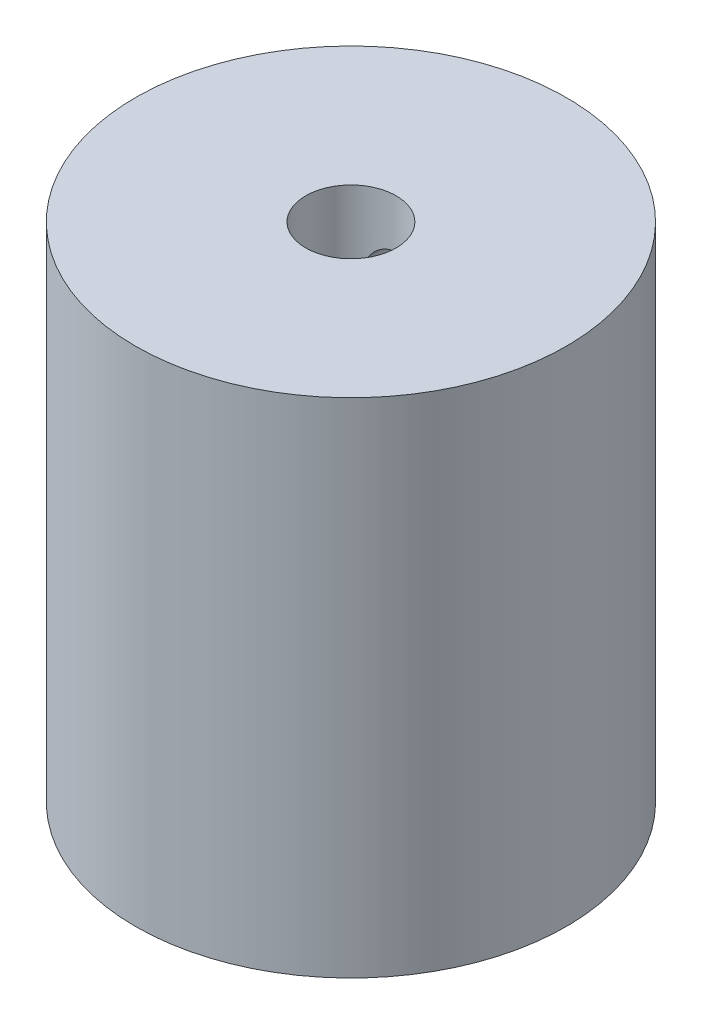
ISO-10303-21;
HEADER;
FILE_DESCRIPTION(('STEP AP214'),'2;1');
FILE_NAME('part.step','',(''),(''),'','','');
FILE_SCHEMA(('AUTOMOTIVE_DESIGN { 1 0 10303 214 1 1 1 1 }'));
ENDSEC;
DATA;
#1=APPLICATION_CONTEXT('core data for automotive mechanical design processes');
#2=APPLICATION_PROTOCOL_DEFINITION('international standard','automotive_design',2000,#1);
#3=PRODUCT_CONTEXT('',#1,'mechanical');
#4=PRODUCT('Part','Part','',(#3));
#5=PRODUCT_RELATED_PRODUCT_CATEGORY('part','',(#4));
#6=PRODUCT_DEFINITION_FORMATION('','',#4);
#7=PRODUCT_DEFINITION_CONTEXT('part definition',#1,'design');
#8=PRODUCT_DEFINITION('design','',#6,#7);
#9=PRODUCT_DEFINITION_SHAPE('','',#8);
#10=(LENGTH_UNIT() NAMED_UNIT(*) SI_UNIT(.MILLI.,.METRE.));
#11=(NAMED_UNIT(*) PLANE_ANGLE_UNIT() SI_UNIT($,.RADIAN.));
#12=(NAMED_UNIT(*) SI_UNIT($,.STERADIAN.) SOLID_ANGLE_UNIT());
#13=UNCERTAINTY_MEASURE_WITH_UNIT(LENGTH_MEASURE(1.E-05),#10,'distance_accuracy_value','');
#14=(GEOMETRIC_REPRESENTATION_CONTEXT(3) GLOBAL_UNCERTAINTY_ASSIGNED_CONTEXT((#13)) GLOBAL_UNIT_ASSIGNED_CONTEXT((#10,
#11,#12)) REPRESENTATION_CONTEXT('',''));
#15=CARTESIAN_POINT('',(0.,0.,0.));
#16=DIRECTION('',(0.,0.,1.));
#17=DIRECTION('',(1.,0.,0.));
#18=AXIS2_PLACEMENT_3D('',#15,#16,#17);
#19=CARTESIAN_POINT('',(0.,50.8,0.));
#20=DIRECTION('',(0.,-1.,0.));
#21=DIRECTION('',(0.,0.,-1.));
#22=AXIS2_PLACEMENT_3D('',#19,#20,#21);
#23=CYLINDRICAL_SURFACE('',#22,19.05);
#24=CARTESIAN_POINT('',(0.,0.,0.));
#25=DIRECTION('',(0.,1.,0.));
#26=DIRECTION('',(0.,0.,1.));
#27=AXIS2_PLACEMENT_3D('',#24,#25,#26);
#28=CIRCLE('',#27,19.05);
#29=CARTESIAN_POINT('',(0.,0.,19.05));
#30=VERTEX_POINT('',#29);
#31=EDGE_CURVE('E42',#30,#30,#28,.T.);
#32=ORIENTED_EDGE('',*,*,#31,.T.);
#33=EDGE_LOOP('',(#32));
#34=FACE_BOUND('',#33,.T.);
#35=CARTESIAN_POINT('',(0.,40.0910968229773,-19.05));
#36=CARTESIAN_POINT('',(-0.111462288333907,40.1016444446425,-19.0499986254831));
#37=CARTESIAN_POINT('',(-0.223885484824858,40.1028176211531,-19.0490113018361));
#38=CARTESIAN_POINT('',(-0.447392160472645,40.0863432467449,-19.0450746746988));
#39=CARTESIAN_POINT('',(-0.558474061276677,40.0686753641748,-19.042123253016));
#40=CARTESIAN_POINT('',(-0.776002773122264,40.0150406690016,-19.0344991232221));
#41=CARTESIAN_POINT('',(-0.882452336153771,39.9790848865815,-19.0298274531316));
#42=CARTESIAN_POINT('',(-1.08776737230284,39.8899301177044,-19.0191966381105));
#43=CARTESIAN_POINT('',(-1.1866342856752,39.8367344158926,-19.0132377385021));
#44=CARTESIAN_POINT('',(-1.37439495961853,39.7143913674772,-19.0005903954759));
#45=CARTESIAN_POINT('',(-1.46325251941923,39.6451887196341,-18.9938994662594));
#46=CARTESIAN_POINT('',(-1.62812104864578,39.4928736432996,-18.9804788627495));
#47=CARTESIAN_POINT('',(-1.7041312922147,39.4097604294067,-18.9737491862892));
#48=CARTESIAN_POINT('',(-1.84142011793276,39.2316166773994,-18.9609191971858));
#49=CARTESIAN_POINT('',(-1.902644439582,39.1365441352471,-18.9548212481803));
#50=CARTESIAN_POINT('',(-2.00824838866711,38.9373945388667,-18.9439243418633));
#51=CARTESIAN_POINT('',(-2.05262839062077,38.8333176849042,-18.9391253556713));
#52=CARTESIAN_POINT('',(-2.12313635293177,38.6194530745283,-18.9313511235054));
#53=CARTESIAN_POINT('',(-2.14932143630461,38.5096843647621,-18.9283701734378));
#54=CARTESIAN_POINT('',(-2.18288913300524,38.2872740548194,-18.924528679991));
#55=CARTESIAN_POINT('',(-2.19027251305868,38.1746325719826,-18.923668050146));
#56=CARTESIAN_POINT('',(-2.18603039786804,37.950352878348,-18.9241584772742));
#57=CARTESIAN_POINT('',(-2.17451211414077,37.8387125955321,-18.9254970602141));
#58=CARTESIAN_POINT('',(-2.13301036933943,37.6189649024836,-18.930219153802));
#59=CARTESIAN_POINT('',(-2.10302686857459,37.5108574998455,-18.9336026688456));
#60=CARTESIAN_POINT('',(-2.02546310064783,37.3012050238598,-18.9420566728828));
#61=CARTESIAN_POINT('',(-1.97787994629412,37.1996610304405,-18.9471274386532));
#62=CARTESIAN_POINT('',(-1.86647794417963,37.0059786475113,-18.9584250889334));
#63=CARTESIAN_POINT('',(-1.80265849988879,36.9138406037555,-18.9646520159189));
#64=CARTESIAN_POINT('',(-1.66016506399712,36.7410204315761,-18.9776575206061));
#65=CARTESIAN_POINT('',(-1.58140805561167,36.660406966814,-18.984439054669));
#66=CARTESIAN_POINT('',(-1.41148463858904,36.51351661597,-18.9978277724568));
#67=CARTESIAN_POINT('',(-1.32031798319862,36.4472400150299,-19.0044349527118));
#68=CARTESIAN_POINT('',(-1.12783477207447,36.3307207461405,-19.0168294671567));
#69=CARTESIAN_POINT('',(-1.02648922299894,36.2805256894293,-19.0226143391906));
#70=CARTESIAN_POINT('',(-0.816735225632816,36.1978880355496,-19.0327732378027));
#71=CARTESIAN_POINT('',(-0.708326961056127,36.1654449768258,-19.0371473010611));
#72=CARTESIAN_POINT('',(-0.487958442219788,36.1193561815773,-19.0440672469612));
#73=CARTESIAN_POINT('',(-0.376013230993062,36.1056395682615,-19.0466200053464));
#74=CARTESIAN_POINT('',(-0.151382336462431,36.0971885471914,-19.0497296086992));
#75=CARTESIAN_POINT('',(-0.0386966748649211,36.1024535854436,-19.0502865119164));
#76=CARTESIAN_POINT('',(0.18368362131808,36.1317522600751,-19.0494376207646));
#77=CARTESIAN_POINT('',(0.293389388079409,36.155701764231,-19.048040602197));
#78=CARTESIAN_POINT('',(0.50722671228206,36.2215759815928,-19.0435465774114));
#79=CARTESIAN_POINT('',(0.611358217503597,36.263500863159,-19.0404495552707));
#80=CARTESIAN_POINT('',(0.811253713655526,36.3641925753549,-19.0329818023438));
#81=CARTESIAN_POINT('',(0.907006429640227,36.4229816579764,-19.0286093885733));
#82=CARTESIAN_POINT('',(1.08731871193081,36.5557162614378,-19.0191588408014));
#83=CARTESIAN_POINT('',(1.17187793919961,36.6296622411888,-19.0140806854336));
#84=CARTESIAN_POINT('',(1.32780081229545,36.7910063205044,-19.003830966767));
#85=CARTESIAN_POINT('',(1.39910325341015,36.878463560052,-18.9986590855818));
#86=CARTESIAN_POINT('',(1.5260277903391,37.0641288950119,-18.988886352215));
#87=CARTESIAN_POINT('',(1.58164986136074,37.1623370074223,-18.9842855009362));
#88=CARTESIAN_POINT('',(1.67565264686235,37.3667951532447,-18.9762200328876));
#89=CARTESIAN_POINT('',(1.71402402562135,37.4730495048622,-18.9727560316308));
#90=CARTESIAN_POINT('',(1.77236686205823,37.690532622102,-18.9673952411231));
#91=CARTESIAN_POINT('',(1.79233880267813,37.8017612570807,-18.9654984107377));
#92=CARTESIAN_POINT('',(1.81325656040918,38.0255672797187,-18.9635100400516));
#93=CARTESIAN_POINT('',(1.81427686501878,38.1381376461198,-18.9634114320466));
#94=CARTESIAN_POINT('',(1.79745221610363,38.3618455057139,-18.9650134372432));
#95=CARTESIAN_POINT('',(1.77960743190072,38.4729830117583,-18.9667140342962));
#96=CARTESIAN_POINT('',(1.72562007016188,38.6904797933734,-18.9717015913895));
#97=CARTESIAN_POINT('',(1.68950869843779,38.7968468822509,-18.9749858455359));
#98=CARTESIAN_POINT('',(1.60004288010323,39.0020130768677,-18.9827386704948));
#99=CARTESIAN_POINT('',(1.54668861682472,39.1008122630576,-18.9872072287154));
#100=CARTESIAN_POINT('',(1.4240459935309,39.2883955373522,-18.9967990874949));
#101=CARTESIAN_POINT('',(1.35470619570617,39.377145885421,-19.0019244774194));
#102=CARTESIAN_POINT('',(1.20211758446651,39.5417952572049,-19.012186746575));
#103=CARTESIAN_POINT('',(1.11886539954164,39.617691156791,-19.0173236282926));
#104=CARTESIAN_POINT('',(0.94051207529221,39.7546950373763,-19.0269790259655));
#105=CARTESIAN_POINT('',(0.845373047080914,39.8157538056972,-19.0314954630325));
#106=CARTESIAN_POINT('',(0.6462106142411,39.9209638142367,-19.0392962057982));
#107=CARTESIAN_POINT('',(0.542197237969539,39.9651338378104,-19.0425818802454));
#108=CARTESIAN_POINT('',(0.364701051125943,40.0234068828396,-19.0466401256108));
#109=CARTESIAN_POINT('',(0.292864934641595,40.042626632472,-19.0478873495204));
#110=CARTESIAN_POINT('',(0.147493560764058,40.0729722689485,-19.0495677412892));
#111=CARTESIAN_POINT('',(0.0739583093861158,40.0840981844417,-19.0500009120299));
#112=CARTESIAN_POINT('',(0.,40.0910968229773,-19.05));
#113=B_SPLINE_CURVE_WITH_KNOTS('',3,(#35,#36,#37,#38,#39,#40,#41,#42,#43,#44,#45,#46,#47,#48,
#49,#50,#51,#52,#53,#54,#55,#56,#57,#58,#59,#60,#61,#62,#63,#64,#65,#66,#67,#68,#69,#70,#71,#72,
#73,#74,#75,#76,#77,#78,#79,#80,#81,#82,#83,#84,#85,#86,#87,#88,#89,#90,#91,#92,#93,#94,#95,#96,
#97,#98,#99,#100,#101,#102,#103,#104,#105,#106,#107,#108,#109,#110,#111,#112),.UNSPECIFIED.,.T.,
.F.,(4,2,2,2,2,2,2,2,2,2,2,2,2,2,2,2,2,2,2,2,2,2,2,2,2,2,2,2,2,2,2,2,2,2,2,2,2,2,4),(0.,
0.335609641898661,0.671581811697275,1.00735158276076,1.34305741867082,1.67994085676281,
2.01684332197983,2.35496395912798,2.69307707803787,3.03012383415124,3.36715684541785,
3.70228478197322,4.03741343888479,4.37259709745657,4.70779307263589,5.04490961646615,
5.38203286449639,5.72014517355423,6.0582486912125,6.39506895659072,6.73187939170393,
7.06718193223751,7.40248761334199,7.73823777516334,8.07399810412051,8.41127205539059,
8.74854653992923,9.08600333143046,9.42345126523133,9.75957261200553,10.0956909419796,
10.4312369921317,10.7667794747676,11.1034171107523,11.4401364456873,11.7779578362099,
12.1154024074063,12.3380894700681,12.560775744498),.UNSPECIFIED.);
#114=CARTESIAN_POINT('',(0.,40.0910968229773,-19.05));
#115=VERTEX_POINT('',#114);
#116=EDGE_CURVE('E91',#115,#115,#113,.T.);
#117=ORIENTED_EDGE('',*,*,#116,.T.);
#118=EDGE_LOOP('',(#117));
#119=FACE_BOUND('',#118,.T.);
#120=CARTESIAN_POINT('',(0.,16.7,-19.05));
#121=CARTESIAN_POINT('',(-0.222068925322549,16.699992124563,-19.0499958890331));
#122=CARTESIAN_POINT('',(-0.444235075035388,16.6814445605494,-19.0460773116431));
#123=CARTESIAN_POINT('',(-0.882271537038069,16.607812711146,-19.0308235650712));
#124=CARTESIAN_POINT('',(-1.09813698237215,16.5527009229103,-19.0194828131717));
#125=CARTESIAN_POINT('',(-1.51717686815667,16.4077311763298,-18.9906491711922));
#126=CARTESIAN_POINT('',(-1.72036380510909,16.3179080800083,-18.9731624553515));
#127=CARTESIAN_POINT('',(-2.10877290109242,16.106172791117,-18.9339307078345));
#128=CARTESIAN_POINT('',(-2.29399581150178,15.9842619414694,-18.9121858543776));
#129=CARTESIAN_POINT('',(-2.64398067088604,15.7098938257733,-18.8664641330736));
#130=CARTESIAN_POINT('',(-2.80843747373957,15.5570515870158,-18.8424614095206));
#131=CARTESIAN_POINT('',(-3.10957763327856,15.2259863279562,-18.7951141928768));
#132=CARTESIAN_POINT('',(-3.24625866456806,15.0477611847124,-18.7717697550388));
#133=CARTESIAN_POINT('',(-3.48929104663889,14.6687623018821,-18.7281285478734));
#134=CARTESIAN_POINT('',(-3.59532178856858,14.4677788097036,-18.7078649771252));
#135=CARTESIAN_POINT('',(-3.77198848371869,14.0503519372427,-18.6730491291224));
#136=CARTESIAN_POINT('',(-3.84262831460581,13.8339102536343,-18.6584962262065));
#137=CARTESIAN_POINT('',(-3.94550800161392,13.3950083947487,-18.6370119818747));
#138=CARTESIAN_POINT('',(-3.97828582224052,13.1726796501261,-18.6299739764396));
#139=CARTESIAN_POINT('',(-4.00618294523534,12.7255758102061,-18.6239957247587));
#140=CARTESIAN_POINT('',(-4.00130650220157,12.500800994159,-18.6250545636412));
#141=CARTESIAN_POINT('',(-3.95446741168988,12.0591543428282,-18.6350536290509));
#142=CARTESIAN_POINT('',(-3.91312574011326,11.842213212293,-18.6438618823821));
#143=CARTESIAN_POINT('',(-3.79551181000077,11.4184160573753,-18.6681590654145));
#144=CARTESIAN_POINT('',(-3.7192377303702,11.2115605593987,-18.6836483434082));
#145=CARTESIAN_POINT('',(-3.53334311031738,10.8120398996319,-18.7196947016604));
#146=CARTESIAN_POINT('',(-3.42348028986359,10.6194909093622,-18.7402883893546));
#147=CARTESIAN_POINT('',(-3.17369742321451,10.2553299532651,-18.7842002311989));
#148=CARTESIAN_POINT('',(-3.03377358572095,10.0837206326352,-18.807518728833));
#149=CARTESIAN_POINT('',(-2.72453546628349,9.76273132831383,-18.8548216674733));
#150=CARTESIAN_POINT('',(-2.55469219759243,9.6138610919571,-18.8788101315769));
#151=CARTESIAN_POINT('',(-2.19218417647366,9.34663856334619,-18.9243268374777));
#152=CARTESIAN_POINT('',(-1.99951907116605,9.22828674306926,-18.9458550412231));
#153=CARTESIAN_POINT('',(-1.59624102671132,9.02534988401876,-18.9840870793149));
#154=CARTESIAN_POINT('',(-1.38559562348826,8.9408275600518,-19.0007819376649));
#155=CARTESIAN_POINT('',(-0.952664921948436,8.80851641409334,-19.0273988976709));
#156=CARTESIAN_POINT('',(-0.730381185010913,8.76072267807545,-19.0373219053329));
#157=CARTESIAN_POINT('',(-0.28485989075043,8.70395737117101,-19.049149480448));
#158=CARTESIAN_POINT('',(-0.061714838399146,8.69428887879044,-19.0511979746538));
#159=CARTESIAN_POINT('',(0.383001961614817,8.71216531317421,-19.0474473370268));
#160=CARTESIAN_POINT('',(0.604573806347773,8.73970792351867,-19.0416486936844));
#161=CARTESIAN_POINT('',(1.03757450773072,8.83064625721493,-19.0229457857817));
#162=CARTESIAN_POINT('',(1.24908270909998,8.89368023589078,-19.010113248408));
#163=CARTESIAN_POINT('',(1.65852586547622,9.05341345993724,-18.9787773959848));
#164=CARTESIAN_POINT('',(1.85645972706494,9.15011541347253,-18.9602736247702));
#165=CARTESIAN_POINT('',(2.2360448845367,9.3759181491571,-18.9192909648564));
#166=CARTESIAN_POINT('',(2.417444259199,9.50543321529357,-18.8967624235737));
#167=CARTESIAN_POINT('',(2.75618489864534,9.79263583297054,-18.8503376155355));
#168=CARTESIAN_POINT('',(2.91352329640621,9.95032673700008,-18.8264411862527));
#169=CARTESIAN_POINT('',(3.20239990817954,10.2925910331731,-18.7794824306353));
#170=CARTESIAN_POINT('',(3.33345745712966,10.4775734966044,-18.7564410101124));
#171=CARTESIAN_POINT('',(3.56264507746954,10.8673346631343,-18.7142644792401));
#172=CARTESIAN_POINT('',(3.66077652930163,11.072112535837,-18.6951292051368));
#173=CARTESIAN_POINT('',(3.82069185787998,11.4945797842213,-18.6631045656276));
#174=CARTESIAN_POINT('',(3.88267333804618,11.7121916681422,-18.6501813135812));
#175=CARTESIAN_POINT('',(3.96911860327334,12.1550450380471,-18.6319774664542));
#176=CARTESIAN_POINT('',(3.99358785194212,12.3802854080668,-18.6266957583988));
#177=CARTESIAN_POINT('',(4.00409587895899,12.8271656714027,-18.6244391951431));
#178=CARTESIAN_POINT('',(3.99089548033069,13.0487871884021,-18.6272998829629));
#179=CARTESIAN_POINT('',(3.92812942119298,13.4865738154656,-18.640635996824));
#180=CARTESIAN_POINT('',(3.87856412163439,13.7027389796663,-18.6511113472837));
#181=CARTESIAN_POINT('',(3.74482955393731,14.1229298421152,-18.6784194448329));
#182=CARTESIAN_POINT('',(3.66076270312905,14.3269894408091,-18.6952333640481));
#183=CARTESIAN_POINT('',(3.46050261504679,14.7182238959422,-18.7333330032989));
#184=CARTESIAN_POINT('',(3.34430633810606,14.905397152593,-18.7546191463922));
#185=CARTESIAN_POINT('',(3.08052640829362,15.2613146015125,-18.799761802575));
#186=CARTESIAN_POINT('',(2.93239704200651,15.42964927971,-18.8236588987998));
#187=CARTESIAN_POINT('',(2.6100718526422,15.739322773776,-18.8710494636146));
#188=CARTESIAN_POINT('',(2.43587003354924,15.8806553627702,-18.8945428379694));
#189=CARTESIAN_POINT('',(2.06388072100253,16.1338930103403,-18.9388055080564));
#190=CARTESIAN_POINT('',(1.86584011856859,16.2454327355831,-18.9595395475968));
#191=CARTESIAN_POINT('',(1.45343664588518,16.4334684099519,-18.9955971543492));
#192=CARTESIAN_POINT('',(1.23908814660464,16.5099948060187,-19.010925419653));
#193=CARTESIAN_POINT('',(0.853661563895487,16.6116245155711,-19.0315926707954));
#194=CARTESIAN_POINT('',(0.684722698580901,16.6447040979823,-19.0384538019923));
#195=CARTESIAN_POINT('',(0.343875247613555,16.6888944717263,-19.0476589724282));
#196=CARTESIAN_POINT('',(0.17196677516171,16.7000060986178,-19.0500031834698));
#197=CARTESIAN_POINT('',(0.,16.7,-19.05));
#198=B_SPLINE_CURVE_WITH_KNOTS('',3,(#120,#121,#122,#123,#124,#125,#126,#127,#128,#129,#130,
#131,#132,#133,#134,#135,#136,#137,#138,#139,#140,#141,#142,#143,#144,#145,#146,#147,#148,#149,
#150,#151,#152,#153,#154,#155,#156,#157,#158,#159,#160,#161,#162,#163,#164,#165,#166,#167,#168,
#169,#170,#171,#172,#173,#174,#175,#176,#177,#178,#179,#180,#181,#182,#183,#184,#185,#186,#187,
#188,#189,#190,#191,#192,#193,#194,#195,#196,#197),.UNSPECIFIED.,.T.,.F.,(4,2,2,2,2,2,2,2,2,2,2,
2,2,2,2,2,2,2,2,2,2,2,2,2,2,2,2,2,2,2,2,2,2,2,2,2,2,2,4),(0.,0.665577483555513,1.33165616903821,
1.9970676151165,2.66245121712301,3.33669100559305,4.01098721838724,4.69210067442244,
5.37313948674806,6.04437784331528,6.71554035700825,7.37548947836377,8.03547300807341,
8.70033412689438,9.36527914733833,10.0434434039141,10.721618147892,11.401044366609,
12.0803796670492,12.7472376555101,13.4140541334588,14.0741940339241,14.7343870466057,
15.4033713659849,16.0724353372245,16.7528001366121,17.4331364078156,18.1097180926988,
18.7862012249723,19.4491185439256,20.1120292829813,20.7729862536949,21.4340057769334,
22.107371752777,22.7808928246771,23.4623287382506,24.1431709562993,24.6586035724101,
25.1740165834878),.UNSPECIFIED.);
#199=CARTESIAN_POINT('',(0.,16.7,-19.05));
#200=VERTEX_POINT('',#199);
#201=EDGE_CURVE('E10',#200,#200,#198,.T.);
#202=ORIENTED_EDGE('',*,*,#201,.T.);
#203=EDGE_LOOP('',(#202));
#204=FACE_BOUND('',#203,.T.);
#205=CARTESIAN_POINT('',(0.,44.45,0.));
#206=DIRECTION('',(0.,1.,0.));
#207=DIRECTION('',(0.,0.,1.));
#208=AXIS2_PLACEMENT_3D('',#205,#206,#207);
#209=CIRCLE('',#208,19.05);
#210=CARTESIAN_POINT('',(0.,44.45,19.05));
#211=VERTEX_POINT('',#210);
#212=EDGE_CURVE('E118',#211,#211,#209,.T.);
#213=ORIENTED_EDGE('',*,*,#212,.F.);
#214=EDGE_LOOP('',(#213));
#215=FACE_BOUND('',#214,.T.);
#216=ADVANCED_FACE('F34',(#34,#119,#204,#215),#23,.T.);
#217=CARTESIAN_POINT('',(0.,25.4,0.));
#218=DIRECTION('',(0.,1.,0.));
#219=DIRECTION('',(0.,0.,1.));
#220=AXIS2_PLACEMENT_3D('',#217,#218,#219);
#221=CYLINDRICAL_SURFACE('',#220,4.0000047);
#222=CARTESIAN_POINT('',(0.,25.4,0.));
#223=DIRECTION('',(0.,1.,0.));
#224=DIRECTION('',(0.,0.,1.));
#225=AXIS2_PLACEMENT_3D('',#222,#223,#224);
#226=CIRCLE('',#225,4.0000047);
#227=CARTESIAN_POINT('',(0.,25.4,4.0000047));
#228=VERTEX_POINT('',#227);
#229=EDGE_CURVE('E47',#228,#228,#226,.T.);
#230=ORIENTED_EDGE('',*,*,#229,.F.);
#231=EDGE_LOOP('',(#230));
#232=FACE_BOUND('',#231,.T.);
#233=CARTESIAN_POINT('',(-2.18850316052976,38.1,-3.34820720929475));
#234=CARTESIAN_POINT('',(-2.1884944304029,38.2022781299785,-3.34821840267547));
#235=CARTESIAN_POINT('',(-2.1805990815075,38.3046949917604,-3.35341495904084));
#236=CARTESIAN_POINT('',(-2.14946786724471,38.5062975409165,-3.37344690303555));
#237=CARTESIAN_POINT('',(-2.12619812161038,38.6054755832608,-3.38830357733403));
#238=CARTESIAN_POINT('',(-2.06571100695699,38.7972367341408,-3.42550948670615));
#239=CARTESIAN_POINT('',(-2.02858046533959,38.8898567143113,-3.4478119892699));
#240=CARTESIAN_POINT('',(-1.94173254670474,39.0674557297682,-3.4974572629338));
#241=CARTESIAN_POINT('',(-1.89201437210667,39.1524342804138,-3.52480035338703));
#242=CARTESIAN_POINT('',(-1.77577408698848,39.3215147211666,-3.58487712852418));
#243=CARTESIAN_POINT('',(-1.70808464910241,39.4047194288201,-3.61787647758237));
#244=CARTESIAN_POINT('',(-1.560323073814,39.5592990123534,-3.68401789074684));
#245=CARTESIAN_POINT('',(-1.48024322761059,39.6306664659146,-3.71716003112711));
#246=CARTESIAN_POINT('',(-1.30073403276202,39.7663679171168,-3.78393259807259));
#247=CARTESIAN_POINT('',(-1.20018364228522,39.8293610542193,-3.81730221454794));
#248=CARTESIAN_POINT('',(-0.98797279534801,39.9371127337521,-3.87763909996497));
#249=CARTESIAN_POINT('',(-0.876318235441333,39.9818808903859,-3.90460974140963));
#250=CARTESIAN_POINT('',(-0.652520461038015,40.0486991218174,-3.94796057556278));
#251=CARTESIAN_POINT('',(-0.540872607693723,40.0720275058841,-3.96491132848344));
#252=CARTESIAN_POINT('',(-0.314239836798642,40.0992965272806,-3.98926576051751));
#253=CARTESIAN_POINT('',(-0.199257643098608,40.1032525648893,-3.99667701970938));
#254=CARTESIAN_POINT('',(0.0180237655762515,40.0919707035726,-4.00128755475805));
#255=CARTESIAN_POINT('',(0.120409145327254,40.0786683714472,-3.99946030392493));
#256=CARTESIAN_POINT('',(0.321517073031992,40.0366029468605,-3.98833361047159));
#257=CARTESIAN_POINT('',(0.420239614250007,40.0078398259694,-3.97903415411118));
#258=CARTESIAN_POINT('',(0.610775045676808,39.936152328759,-3.95426020514948));
#259=CARTESIAN_POINT('',(0.702629149454106,39.8933224368836,-3.93882677205921));
#260=CARTESIAN_POINT('',(0.878185953016703,39.7947909900025,-3.9034416509819));
#261=CARTESIAN_POINT('',(0.961886163740379,39.7390855219846,-3.88348858947295));
#262=CARTESIAN_POINT('',(1.12612758063989,39.611111936303,-3.83923078457058));
#263=CARTESIAN_POINT('',(1.20583989774665,39.5378571599636,-3.81470292135931));
#264=CARTESIAN_POINT('',(1.35242903888901,39.3795237803228,-3.76523180579996));
#265=CARTESIAN_POINT('',(1.41929751626423,39.2944375497585,-3.74028829470389));
#266=CARTESIAN_POINT('',(1.54267469408649,39.1081229242315,-3.69119136234157));
#267=CARTESIAN_POINT('',(1.59820492162458,39.0061989026781,-3.66719947509194));
#268=CARTESIAN_POINT('',(1.69109955991893,38.7932275969482,-3.62530533450885));
#269=CARTESIAN_POINT('',(1.7284764253795,38.6821866290684,-3.6073989085866));
#270=CARTESIAN_POINT('',(1.78185441719786,38.460496873816,-3.58132345228501));
#271=CARTESIAN_POINT('',(1.79891987596194,38.3501636027117,-3.57267225292632));
#272=CARTESIAN_POINT('',(1.81439781787948,38.1278908475421,-3.56484031289378));
#273=CARTESIAN_POINT('',(1.81282184043491,38.0159523999745,-3.5656537134483));
#274=CARTESIAN_POINT('',(1.79213705414682,37.8045058587303,-3.57608469246248));
#275=CARTESIAN_POINT('',(1.77463654282146,37.7047934578228,-3.58489447593977));
#276=CARTESIAN_POINT('',(1.72509814200645,37.5098745290153,-3.60899234196184));
#277=CARTESIAN_POINT('',(1.69305617605346,37.4146692728913,-3.62428224102345));
#278=CARTESIAN_POINT('',(1.61418578312999,37.2276635607348,-3.66010534149101));
#279=CARTESIAN_POINT('',(1.56688284723725,37.1360958870705,-3.68080207511892));
#280=CARTESIAN_POINT('',(1.45916594000513,36.9617109869241,-3.72481600402481));
#281=CARTESIAN_POINT('',(1.39874570538024,36.8788979688251,-3.74813444855158));
#282=CARTESIAN_POINT('',(1.2592781431608,36.7155889744072,-3.79740122994369));
#283=CARTESIAN_POINT('',(1.17896353125564,36.6361786336945,-3.82337656560467));
#284=CARTESIAN_POINT('',(1.00559870300246,36.4916289023058,-3.8725858982404));
#285=CARTESIAN_POINT('',(0.912546334190237,36.4264919284348,-3.8958194306588));
#286=CARTESIAN_POINT('',(0.714851807652179,36.3119529739072,-3.93691484987749));
#287=CARTESIAN_POINT('',(0.610108918202506,36.2627046746065,-3.9547241845003));
#288=CARTESIAN_POINT('',(0.39276015050496,36.1828387800168,-3.98217723228771));
#289=CARTESIAN_POINT('',(0.280160822143259,36.1522058672384,-3.99182766149358));
#290=CARTESIAN_POINT('',(0.061069806672386,36.112792306547,-4.00090727434662));
#291=CARTESIAN_POINT('',(-0.045085580286732,36.1023237182156,-4.00116231438237));
#292=CARTESIAN_POINT('',(-0.257373818376916,36.0983709971328,-3.99312744251863));
#293=CARTESIAN_POINT('',(-0.363506669120251,36.1048829875414,-3.98483948133503));
#294=CARTESIAN_POINT('',(-0.567312475452336,36.1336378754805,-3.96083549708654));
#295=CARTESIAN_POINT('',(-0.665144912671912,36.1550924105598,-3.94550431138684));
#296=CARTESIAN_POINT('',(-0.855451627124892,36.2118668364099,-3.90866251689987));
#297=CARTESIAN_POINT('',(-0.947924900096445,36.247189316336,-3.88715075439567));
#298=CARTESIAN_POINT('',(-1.13088122721322,36.3328782564398,-3.83805117514352));
#299=CARTESIAN_POINT('',(-1.22093134366037,36.3840039439346,-3.8101815158382));
#300=CARTESIAN_POINT('',(-1.39142872773225,36.4988898434935,-3.7512816543463));
#301=CARTESIAN_POINT('',(-1.47187089488486,36.562656718902,-3.72024978952791));
#302=CARTESIAN_POINT('',(-1.63008760462597,36.7090745536958,-3.65389971731174));
#303=CARTESIAN_POINT('',(-1.70662376710105,36.7930242467212,-3.61848199490624));
#304=CARTESIAN_POINT('',(-1.84487200656139,36.9733330592404,-3.54999261181833));
#305=CARTESIAN_POINT('',(-1.90656939729408,37.0697043289672,-3.51692329802689));
#306=CARTESIAN_POINT('',(-2.01460374745787,37.2758719616801,-3.45620765254901));
#307=CARTESIAN_POINT('',(-2.06051101888525,37.3859470218439,-3.4287202952848));
#308=CARTESIAN_POINT('',(-2.11431850556389,37.5570318188717,-3.39560451856878));
#309=CARTESIAN_POINT('',(-2.1297365902923,37.6149874814546,-3.38592476157086));
#310=CARTESIAN_POINT('',(-2.15535607567979,37.7324510040909,-3.3696752298573));
#311=CARTESIAN_POINT('',(-2.16556166775395,37.7919575764425,-3.3631029567011));
#312=CARTESIAN_POINT('',(-2.17819007645512,37.8929763981079,-3.35493098683599));
#313=CARTESIAN_POINT('',(-2.18205255258444,37.9342416681691,-3.35241661045777));
#314=CARTESIAN_POINT('',(-2.18721099923633,38.0169969919991,-3.34905236388782));
#315=CARTESIAN_POINT('',(-2.1885067039379,38.0584870686034,-3.3482026660943));
#316=CARTESIAN_POINT('',(-2.18850316052976,38.1,-3.34820720929475));
#317=B_SPLINE_CURVE_WITH_KNOTS('',3,(#233,#234,#235,#236,#237,#238,#239,#240,#241,#242,#243,
#244,#245,#246,#247,#248,#249,#250,#251,#252,#253,#254,#255,#256,#257,#258,#259,#260,#261,#262,
#263,#264,#265,#266,#267,#268,#269,#270,#271,#272,#273,#274,#275,#276,#277,#278,#279,#280,#281,
#282,#283,#284,#285,#286,#287,#288,#289,#290,#291,#292,#293,#294,#295,#296,#297,#298,#299,#300,
#301,#302,#303,#304,#305,#306,#307,#308,#309,#310,#311,#312,#313,#314,#315,#316),.UNSPECIFIED.,
.T.,.F.,(4,2,2,2,2,2,2,2,2,2,2,2,2,2,2,2,2,2,2,2,2,2,2,2,2,2,2,2,2,2,2,2,2,2,2,2,2,2,2,2,2,4),
(0.,0.306661723354928,0.614001495447451,0.91944747034191,1.22491280382314,1.56022887610277,
1.89575441336615,2.2636184882217,2.63128825190089,2.97525981237811,3.31895788409979,
3.62724456445323,3.93553181169762,4.24178929816621,4.54813998191631,4.87973907113439,
5.21155292865033,5.56532610328867,5.91885621626345,6.2529067028507,6.58675041668887,
6.89021886401505,7.19377243644884,7.50785932112568,7.82209650805073,8.16818431172019,
8.51433067070211,8.86373115072717,9.21284373930146,9.53118854759517,9.8494606808736,
10.1521002915271,10.4547964321058,10.7752013186229,11.0957755462064,11.4511632496258,
11.8069012536879,12.171669777902,12.3536484653475,12.5354805906992,12.6599364142272,
12.7844051260256),.UNSPECIFIED.);
#318=CARTESIAN_POINT('',(-2.18850316052976,38.1,-3.34820720929475));
#319=VERTEX_POINT('',#318);
#320=EDGE_CURVE('E86',#319,#319,#317,.T.);
#321=ORIENTED_EDGE('',*,*,#320,.T.);
#322=EDGE_LOOP('',(#321));
#323=FACE_BOUND('',#322,.T.);
#324=CARTESIAN_POINT('',(0.,36.1089031770227,4.0000047));
#325=CARTESIAN_POINT('',(0.105722005968482,36.1189198876956,3.99999829910437));
#326=CARTESIAN_POINT('',(0.210779208982802,36.1374053526245,3.99576791693113));
#327=CARTESIAN_POINT('',(0.41619125726617,36.1906402591726,3.97963543758881));
#328=CARTESIAN_POINT('',(0.516535745724085,36.2254238320162,3.9677172208616));
#329=CARTESIAN_POINT('',(0.70930459855935,36.3097592869777,3.93781666383938));
#330=CARTESIAN_POINT('',(0.801759880715031,36.3592497541267,3.91985950148499));
#331=CARTESIAN_POINT('',(0.977179092163339,36.4714921839532,3.87985373242204));
#332=CARTESIAN_POINT('',(1.06014381336333,36.5342430389171,3.85780546748467));
#333=CARTESIAN_POINT('',(1.21987080561899,36.6757268311079,3.81042174610676));
#334=CARTESIAN_POINT('',(1.29593745360082,36.7552055178438,3.78496750616135));
#335=CARTESIAN_POINT('',(1.43418160413739,36.9257129256404,3.73477985325307));
#336=CARTESIAN_POINT('',(1.49635152382003,37.0167479102275,3.71004684020289));
#337=CARTESIAN_POINT('',(1.60785758024488,37.2131844248921,3.66315092793704));
#338=CARTESIAN_POINT('',(1.65642954009531,37.3190672682974,3.64116967235679));
#339=CARTESIAN_POINT('',(1.734668256141,37.5387734957882,3.60456052428096));
#340=CARTESIAN_POINT('',(1.76435289639544,37.6525892546699,3.58992567838396));
#341=CARTESIAN_POINT('',(1.80182635229963,37.8755705825806,3.57125565910549));
#342=CARTESIAN_POINT('',(1.8111237208077,37.9844204611951,3.56649176762262));
#343=CARTESIAN_POINT('',(1.81184750516752,38.2021769411103,3.56612555650796));
#344=CARTESIAN_POINT('',(1.80327979598495,38.3110835119928,3.57052022506556));
#345=CARTESIAN_POINT('',(1.77003809195016,38.5174070848073,3.58710194480146));
#346=CARTESIAN_POINT('',(1.74660300266844,38.6150779095115,3.5986882343722));
#347=CARTESIAN_POINT('',(1.68575636166771,38.8050585905212,3.62758740342207));
#348=CARTESIAN_POINT('',(1.64834059421902,38.8973668200803,3.64490201003562));
#349=CARTESIAN_POINT('',(1.55801417430275,39.0801481195226,3.68445312653343));
#350=CARTESIAN_POINT('',(1.50430489781287,39.1701744990069,3.70692355474283));
#351=CARTESIAN_POINT('',(1.38377229210733,39.3405028208336,3.75358316690589));
#352=CARTESIAN_POINT('',(1.31694200809023,39.4207995693151,3.77777325801166));
#353=CARTESIAN_POINT('',(1.16463931658397,39.5771587270107,3.82761653375519));
#354=CARTESIAN_POINT('',(1.07800784962275,39.6521224112157,3.85319490823815));
#355=CARTESIAN_POINT('',(0.892478577722044,39.7865930436423,3.90034193905956));
#356=CARTESIAN_POINT('',(0.793581768594448,39.8461012454681,3.92191092056211));
#357=CARTESIAN_POINT('',(0.587714492630396,39.9467216217177,3.95794787535126));
#358=CARTESIAN_POINT('',(0.480908959568448,39.9881280415864,3.97252983097728));
#359=CARTESIAN_POINT('',(0.261041547772513,40.0521760681745,3.99299964985255));
#360=CARTESIAN_POINT('',(0.147984775029227,40.0748327549571,3.99889450296289));
#361=CARTESIAN_POINT('',(-0.0699038227528762,40.0992085695157,4.0007404861427));
#362=CARTESIAN_POINT('',(-0.174538008904065,40.102658741539,3.9975547249352));
#363=CARTESIAN_POINT('',(-0.382489413361365,40.0932882556174,3.98303866478752));
#364=CARTESIAN_POINT('',(-0.485806752698557,40.0804691040342,3.97170911991494));
#365=CARTESIAN_POINT('',(-0.685270461373114,40.0399211066845,3.9421228260626));
#366=CARTESIAN_POINT('',(-0.781537160381606,40.0126261047807,3.92407198110652));
#367=CARTESIAN_POINT('',(-0.967859434099243,39.9445729771571,3.88232039694961));
#368=CARTESIAN_POINT('',(-1.0579136159706,39.9038118441309,3.85861839604093));
#369=CARTESIAN_POINT('',(-1.23674468486864,39.806553801356,3.80524098861128));
#370=CARTESIAN_POINT('',(-1.32490217474173,39.7490950277631,3.77524816309945));
#371=CARTESIAN_POINT('',(-1.49069596082293,39.6215941692303,3.71291299694917));
#372=CARTESIAN_POINT('',(-1.56832456325182,39.5515429686134,3.68056896443826));
#373=CARTESIAN_POINT('',(-1.71932195327778,39.3922302210046,3.61268802841173));
#374=CARTESIAN_POINT('',(-1.79139631420565,39.3017258236578,3.57717094521164));
#375=CARTESIAN_POINT('',(-1.91945358072902,39.1085879617556,3.51012356401689));
#376=CARTESIAN_POINT('',(-1.97543321348576,39.0059520362514,3.47859407762311));
#377=CARTESIAN_POINT('',(-2.0687452099048,38.791499451663,3.423925087845));
#378=CARTESIAN_POINT('',(-2.10625564634755,38.6797830712809,3.40070607815607));
#379=CARTESIAN_POINT('',(-2.14744671938701,38.5074803826916,3.37472402507738));
#380=CARTESIAN_POINT('',(-2.15866361377189,38.4492750983085,3.36753852606162));
#381=CARTESIAN_POINT('',(-2.17591140542853,38.331801488516,3.35641937146021));
#382=CARTESIAN_POINT('',(-2.18194340617863,38.2725333920427,3.35248502395302));
#383=CARTESIAN_POINT('',(-2.19100248992829,38.1122582771208,3.34658440618696));
#384=CARTESIAN_POINT('',(-2.18905110438318,38.0107867794302,3.3478709563827));
#385=CARTESIAN_POINT('',(-2.16993547477525,37.8099597000383,3.36028724062131));
#386=CARTESIAN_POINT('',(-2.1527682352369,37.7106045389146,3.37141891282737));
#387=CARTESIAN_POINT('',(-2.10552187878786,37.5220979625408,3.40110793606264));
#388=CARTESIAN_POINT('',(-2.07619356262883,37.4326853950203,3.41922979550277));
#389=CARTESIAN_POINT('',(-2.00591921457831,37.259937361338,3.46092323139347));
#390=CARTESIAN_POINT('',(-1.96496969510224,37.1766037289485,3.48449644342999));
#391=CARTESIAN_POINT('',(-1.86652378092614,37.0067997966072,3.53831301153325));
#392=CARTESIAN_POINT('',(-1.80757040101308,36.9213236188933,3.56902490754803));
#393=CARTESIAN_POINT('',(-1.67751373890674,36.760770050422,3.63197078384738));
#394=CARTESIAN_POINT('',(-1.60640184549207,36.6857000985422,3.66420583110769));
#395=CARTESIAN_POINT('',(-1.44354514016332,36.5384717517249,3.73160904871441));
#396=CARTESIAN_POINT('',(-1.35033097953473,36.4678607179876,3.76663771309063));
#397=CARTESIAN_POINT('',(-1.151797188402,36.3433552614132,3.832013815275));
#398=CARTESIAN_POINT('',(-1.04647487882299,36.2894645479441,3.86236021358268));
#399=CARTESIAN_POINT('',(-0.829142160534348,36.2018727711921,3.91467160033766));
#400=CARTESIAN_POINT('',(-0.717391254832496,36.1676628855827,3.93684193004379));
#401=CARTESIAN_POINT('',(-0.545800162260028,36.1313026250344,3.96301831357322));
#402=CARTESIAN_POINT('',(-0.487985201990776,36.1216765217828,3.97056104612316));
#403=CARTESIAN_POINT('',(-0.371477345921405,36.1075255735141,3.98314717991085));
#404=CARTESIAN_POINT('',(-0.312785023652402,36.1029975319891,3.98819214614638));
#405=CARTESIAN_POINT('',(-0.211638587007533,36.099685715334,3.99462710688345));
#406=CARTESIAN_POINT('',(-0.169260340524817,36.0996445005223,3.99664600767509));
#407=CARTESIAN_POINT('',(-0.0845527169763789,36.1022530220922,3.99933606657415));
#408=CARTESIAN_POINT('',(-0.0422233387841556,36.1049026951517,4.00000725639478));
#409=CARTESIAN_POINT('',(0.,36.1089031770227,4.0000047));
#410=B_SPLINE_CURVE_WITH_KNOTS('',3,(#324,#325,#326,#327,#328,#329,#330,#331,#332,#333,#334,
#335,#336,#337,#338,#339,#340,#341,#342,#343,#344,#345,#346,#347,#348,#349,#350,#351,#352,#353,
#354,#355,#356,#357,#358,#359,#360,#361,#362,#363,#364,#365,#366,#367,#368,#369,#370,#371,#372,
#373,#374,#375,#376,#377,#378,#379,#380,#381,#382,#383,#384,#385,#386,#387,#388,#389,#390,#391,
#392,#393,#394,#395,#396,#397,#398,#399,#400,#401,#402,#403,#404,#405,#406,#407,#408,#409),
.UNSPECIFIED.,.T.,.F.,(4,2,2,2,2,2,2,2,2,2,2,2,2,2,2,2,2,2,2,2,2,2,2,2,2,2,2,2,2,2,2,2,2,2,2,2,
2,2,2,2,2,2,4),(0.,0.318420463901669,0.63751075952306,0.955286846011343,1.27303639739084,
1.61033488667242,1.94781697897752,2.30158637040095,2.65502028355143,2.98126886088169,
3.30741016765085,3.60941469653238,3.91151036535966,4.23183146893825,4.55232281962334,
4.90279409488833,5.2532369343164,5.59774983060268,5.94198537151013,6.25462194313024,
6.56722957012813,6.87095775852526,7.17475382253671,7.5016823951978,7.82884859205511,
8.19022844172664,8.55168172555606,8.90957822843879,9.08842631671043,9.26723633209053,
9.56994907316343,9.87272142114789,10.1590723214602,10.4455092482322,10.769083124992,
11.0928871282928,11.4573224352538,11.8218385337085,12.1764496287834,12.353501530522,
12.5304423579787,12.6576163685588,12.7847873865504),.UNSPECIFIED.);
#411=CARTESIAN_POINT('',(0.,36.1089031770227,4.0000047));
#412=VERTEX_POINT('',#411);
#413=EDGE_CURVE('E54',#412,#412,#410,.T.);
#414=ORIENTED_EDGE('',*,*,#413,.T.);
#415=EDGE_LOOP('',(#414));
#416=FACE_BOUND('',#415,.T.);
#417=CARTESIAN_POINT('',(0.,44.45,0.));
#418=DIRECTION('',(0.,1.,0.));
#419=DIRECTION('',(0.,0.,1.));
#420=AXIS2_PLACEMENT_3D('',#417,#418,#419);
#421=CIRCLE('',#420,4.0000047);
#422=CARTESIAN_POINT('',(0.,44.45,4.0000047));
#423=VERTEX_POINT('',#422);
#424=EDGE_CURVE('E38',#423,#423,#421,.F.);
#425=ORIENTED_EDGE('',*,*,#424,.F.);
#426=EDGE_LOOP('',(#425));
#427=FACE_BOUND('',#426,.T.);
#428=ADVANCED_FACE('F104',(#232,#323,#416,#427),#221,.F.);
#429=CARTESIAN_POINT('',(0.,0.,0.));
#430=DIRECTION('',(0.,1.,0.));
#431=DIRECTION('',(0.,0.,1.));
#432=AXIS2_PLACEMENT_3D('',#429,#430,#431);
#433=PLANE('',#432);
#434=CARTESIAN_POINT('',(0.,0.,0.));
#435=DIRECTION('',(0.,-1.,0.));
#436=DIRECTION('',(0.,0.,-1.));
#437=AXIS2_PLACEMENT_3D('',#434,#435,#436);
#438=CIRCLE('',#437,2.);
#439=CARTESIAN_POINT('',(0.,0.,-2.));
#440=VERTEX_POINT('',#439);
#441=EDGE_CURVE('E117',#440,#440,#438,.T.);
#442=ORIENTED_EDGE('',*,*,#441,.F.);
#443=EDGE_LOOP('',(#442));
#444=FACE_BOUND('',#443,.T.);
#445=ORIENTED_EDGE('',*,*,#31,.F.);
#446=EDGE_LOOP('',(#445));
#447=FACE_BOUND('',#446,.T.);
#448=ADVANCED_FACE('F107',(#444,#447),#433,.F.);
#449=CARTESIAN_POINT('',(0.,25.4,0.));
#450=DIRECTION('',(0.,1.,0.));
#451=DIRECTION('',(0.,0.,1.));
#452=AXIS2_PLACEMENT_3D('',#449,#450,#451);
#453=PLANE('',#452);
#454=ORIENTED_EDGE('',*,*,#229,.T.);
#455=EDGE_LOOP('',(#454));
#456=FACE_BOUND('',#455,.T.);
#457=ADVANCED_FACE('F82',(#456),#453,.T.);
#458=CARTESIAN_POINT('',(-0.188503160529763,38.1,6.35));
#459=DIRECTION('',(0.,0.,-1.));
#460=DIRECTION('',(-1.,0.,0.));
#461=AXIS2_PLACEMENT_3D('',#458,#459,#460);
#462=CYLINDRICAL_SURFACE('',#461,2.);
#463=ORIENTED_EDGE('',*,*,#320,.F.);
#464=EDGE_LOOP('',(#463));
#465=FACE_BOUND('',#464,.T.);
#466=ORIENTED_EDGE('',*,*,#116,.F.);
#467=EDGE_LOOP('',(#466));
#468=FACE_BOUND('',#467,.T.);
#469=ADVANCED_FACE('F78',(#465,#468),#462,.F.);
#470=CARTESIAN_POINT('',(-0.188503160529763,38.1,6.35));
#471=DIRECTION('',(0.,0.,-1.));
#472=DIRECTION('',(-1.,0.,0.));
#473=AXIS2_PLACEMENT_3D('',#470,#471,#472);
#474=CIRCLE('',#473,2.);
#475=CARTESIAN_POINT('',(-2.18850316052976,38.1,6.35));
#476=VERTEX_POINT('',#475);
#477=EDGE_CURVE('E98',#476,#476,#474,.T.);
#478=ORIENTED_EDGE('',*,*,#477,.F.);
#479=EDGE_LOOP('',(#478));
#480=FACE_BOUND('',#479,.T.);
#481=ORIENTED_EDGE('',*,*,#413,.F.);
#482=EDGE_LOOP('',(#481));
#483=FACE_BOUND('',#482,.T.);
#484=ADVANCED_FACE('F76',(#480,#483),#462,.F.);
#485=CARTESIAN_POINT('',(-0.188503160529763,38.1,6.35));
#486=DIRECTION('',(0.,0.,-1.));
#487=DIRECTION('',(-1.,0.,0.));
#488=AXIS2_PLACEMENT_3D('',#485,#486,#487);
#489=PLANE('',#488);
#490=ORIENTED_EDGE('',*,*,#477,.T.);
#491=EDGE_LOOP('',(#490));
#492=FACE_BOUND('',#491,.T.);
#493=ADVANCED_FACE('F72',(#492),#489,.T.);
#494=CARTESIAN_POINT('',(0.,12.7,6.35));
#495=DIRECTION('',(0.,0.,-1.));
#496=DIRECTION('',(-1.,0.,0.));
#497=AXIS2_PLACEMENT_3D('',#494,#495,#496);
#498=CYLINDRICAL_SURFACE('',#497,4.);
#499=CARTESIAN_POINT('',(0.,8.7,-2.));
#500=CARTESIAN_POINT('',(0.105143925902467,8.70000573189918,-1.99999339536562));
#501=CARTESIAN_POINT('',(0.210413199395125,8.70419017960487,-1.99165985375789));
#502=CARTESIAN_POINT('',(0.417840470537792,8.72051687925686,-1.95869423931692));
#503=CARTESIAN_POINT('',(0.519992173427259,8.73267424342161,-1.93403121400437));
#504=CARTESIAN_POINT('',(0.717867089760898,8.76367441193249,-1.86961238276674));
#505=CARTESIAN_POINT('',(0.813613605878293,8.78249121644925,-1.82991523150406));
#506=CARTESIAN_POINT('',(0.996945233613197,8.82508446968477,-1.73685875727003));
#507=CARTESIAN_POINT('',(1.08453098798012,8.84886052732949,-1.68350051150227));
#508=CARTESIAN_POINT('',(1.25501563552382,8.90087483483876,-1.56096550102943));
#509=CARTESIAN_POINT('',(1.33731042224422,8.92929601744926,-1.49102704152072));
#510=CARTESIAN_POINT('',(1.48955888973396,8.98680059506514,-1.33895704150593));
#511=CARTESIAN_POINT('',(1.55950316621353,9.01588447581931,-1.25681629645512));
#512=CARTESIAN_POINT('',(1.69050400090056,9.07402097605305,-1.07503330095324));
#513=CARTESIAN_POINT('',(1.75045067110327,9.10289626059736,-0.974527803308175));
#514=CARTESIAN_POINT('',(1.85233645378139,9.15428042455359,-0.763265328027571));
#515=CARTESIAN_POINT('',(1.89428842993267,9.17679384786021,-0.652515742554502));
#516=CARTESIAN_POINT('',(1.95626488437718,9.21084265924383,-0.430669789156156));
#517=CARTESIAN_POINT('',(1.97745171416088,9.22295456832573,-0.319991095865212));
#518=CARTESIAN_POINT('',(2.00085398661769,9.23636220102945,-0.0960423244410465));
#519=CARTESIAN_POINT('',(2.00308817674615,9.23766861313424,0.0172250817423092));
#520=CARTESIAN_POINT('',(1.98937457434459,9.22978139485503,0.228572048630736));
#521=CARTESIAN_POINT('',(1.97556911907364,9.22182472675973,0.3268480624461));
#522=CARTESIAN_POINT('',(1.93387969811386,9.19847542532299,0.519443818746084));
#523=CARTESIAN_POINT('',(1.9059912477953,9.18308042336447,0.613762290610631));
#524=CARTESIAN_POINT('',(1.83641956077201,9.14625047174518,0.798458265131318));
#525=CARTESIAN_POINT('',(1.79443013423199,9.12468318672003,0.888692797571577));
#526=CARTESIAN_POINT('',(1.698083375336,9.07793191437193,1.06126858518002));
#527=CARTESIAN_POINT('',(1.64372048762494,9.05274630439619,1.14360627120018));
#528=CARTESIAN_POINT('',(1.51613210982558,8.99773684193428,1.30904250548645));
#529=CARTESIAN_POINT('',(1.44138891673856,8.96772979526508,1.39091374715231));
#530=CARTESIAN_POINT('',(1.27911115748275,8.90904753399185,1.5414708371818));
#531=CARTESIAN_POINT('',(1.19157051314857,8.88037296082398,1.61015038406776));
#532=CARTESIAN_POINT('',(1.0010330116637,8.82596025434072,1.73537132205945));
#533=CARTESIAN_POINT('',(0.897507183198819,8.80042031675986,1.79120094489148));
#534=CARTESIAN_POINT('',(0.680932430977594,8.75684237757515,1.88419405808602));
#535=CARTESIAN_POINT('',(0.567891152530553,8.73879842112894,1.92137237003033));
#536=CARTESIAN_POINT('',(0.345532983321406,8.71351332517129,1.97295080743335));
#537=CARTESIAN_POINT('',(0.236683061096653,8.7055012339738,1.98898247149356));
#538=CARTESIAN_POINT('',(0.0175591998987045,8.69853973081793,2.00292946226897));
#539=CARTESIAN_POINT('',(-0.0927140397398161,8.69958602557363,2.00085337127894));
#540=CARTESIAN_POINT('',(-0.302465943971973,8.7101761549313,1.97958662316251));
#541=CARTESIAN_POINT('',(-0.402118816099859,8.71905508623663,1.96173493454001));
#542=CARTESIAN_POINT('',(-0.596813784603881,8.74355657370319,1.91152385620976));
#543=CARTESIAN_POINT('',(-0.691855371382173,8.75917987331176,1.87916286709301));
#544=CARTESIAN_POINT('',(-0.877777216899145,8.79631497172824,1.80000306713393));
#545=CARTESIAN_POINT('',(-0.968460794011606,8.81798236460738,1.75281789976743));
#546=CARTESIAN_POINT('',(-1.14092272339854,8.86512051365165,1.64578492870687));
#547=CARTESIAN_POINT('',(-1.22269725955318,8.89059288866123,1.58593173080921));
#548=CARTESIAN_POINT('',(-1.38353537857843,8.94583557327604,1.44847914933857));
#549=CARTESIAN_POINT('',(-1.46154415563805,8.97578230313002,1.36971426310971));
#550=CARTESIAN_POINT('',(-1.60371264223771,9.0347521678236,1.20014969744454));
#551=CARTESIAN_POINT('',(-1.66786277142375,9.06377465199906,1.10934176230416));
#552=CARTESIAN_POINT('',(-1.78341582895803,9.11897615587021,0.912712691654049));
#553=CARTESIAN_POINT('',(-1.8340509916005,9.14494940821879,0.806377467811038));
#554=CARTESIAN_POINT('',(-1.91616565186941,9.18851855411731,0.584979864850069));
#555=CARTESIAN_POINT('',(-1.94766983173403,9.206125235565,0.469928947066221));
#556=CARTESIAN_POINT('',(-1.98772337493374,9.22876997948396,0.246179554230593));
#557=CARTESIAN_POINT('',(-1.9981859928109,9.2348523306987,0.137931493129518));
#558=CARTESIAN_POINT('',(-2.0013783087524,9.23669290716793,-0.078894134329049));
#559=CARTESIAN_POINT('',(-1.99411569324648,9.2324556074722,-0.187471537475722));
#560=CARTESIAN_POINT('',(-1.96385225118662,9.21524275897847,-0.390967003066874));
#561=CARTESIAN_POINT('',(-1.94241662868607,9.20313811034683,-0.486200940289478));
#562=CARTESIAN_POINT('',(-1.88635071644882,9.17257967624695,-0.671616238848733));
#563=CARTESIAN_POINT('',(-1.85171618231984,9.15412384860663,-0.761795964184063));
#564=CARTESIAN_POINT('',(-1.76763149060113,9.11142939270929,-0.941249701973073));
#565=CARTESIAN_POINT('',(-1.7173422756314,9.08688555208159,-1.03005580365806));
#566=CARTESIAN_POINT('',(-1.60430194327478,9.03529336730279,-1.19854907236252));
#567=CARTESIAN_POINT('',(-1.54154434248312,9.00824372408779,-1.27823146104222));
#568=CARTESIAN_POINT('',(-1.39640665332275,8.95075353683816,-1.43628396470935));
#569=CARTESIAN_POINT('',(-1.31256884599452,8.92030033386744,-1.51331820470058));
#570=CARTESIAN_POINT('',(-1.1323096124664,8.86244495480139,-1.65252596687054));
#571=CARTESIAN_POINT('',(-1.0358814466104,8.8350444274761,-1.71469147893981));
#572=CARTESIAN_POINT('',(-0.831863193565893,8.78603980866925,-1.82247272542414));
#573=CARTESIAN_POINT('',(-0.724199007553463,8.76447807012134,-1.86796833847293));
#574=CARTESIAN_POINT('',(-0.501484202276175,8.72997317402026,-1.93961633551482));
#575=CARTESIAN_POINT('',(-0.386455599178201,8.71700553273864,-1.96582369361143));
#576=CARTESIAN_POINT('',(-0.225203892981791,8.70609076173044,-1.98779482217148));
#577=CARTESIAN_POINT('',(-0.18032375888313,8.70381269319498,-1.99236528173268));
#578=CARTESIAN_POINT('',(-0.0903034636101833,8.70076606046369,-1.99846933102817));
#579=CARTESIAN_POINT('',(-0.045163295293257,8.69999753793238,-2.00000283694042));
#580=CARTESIAN_POINT('',(0.,8.7,-2.));
#581=B_SPLINE_CURVE_WITH_KNOTS('',3,(#499,#500,#501,#502,#503,#504,#505,#506,#507,#508,#509,
#510,#511,#512,#513,#514,#515,#516,#517,#518,#519,#520,#521,#522,#523,#524,#525,#526,#527,#528,
#529,#530,#531,#532,#533,#534,#535,#536,#537,#538,#539,#540,#541,#542,#543,#544,#545,#546,#547,
#548,#549,#550,#551,#552,#553,#554,#555,#556,#557,#558,#559,#560,#561,#562,#563,#564,#565,#566,
#567,#568,#569,#570,#571,#572,#573,#574,#575,#576,#577,#578,#579,#580),.UNSPECIFIED.,.T.,.F.,(4,
2,2,2,2,2,2,2,2,2,2,2,2,2,2,2,2,2,2,2,2,2,2,2,2,2,2,2,2,2,2,2,2,2,2,2,2,2,2,2,4),(0.,
0.315248514840585,0.631096299418395,0.945724310984597,1.26032752116313,1.59396351743618,
1.92785247530807,2.28763452861505,2.64715895796562,2.98516024280459,3.32282714658041,
3.62011424818641,3.91749607851357,4.22180480336975,4.52625042520444,4.86929882667757,
5.21251069197373,5.57166044428881,5.93052433824559,6.25966580942691,6.58865129022952,
6.89213813012244,7.19565843261863,7.50785712055797,7.82018901496678,8.16319221288838,
8.50643177230863,8.86629364323451,9.22569023890901,9.55058615006093,9.87534119729357,
10.1691586049771,10.463070575767,10.7767291356057,11.0905512228726,11.4425048551434,
11.7946476676249,12.1492802732705,12.502898172423,12.6383056026783,12.7737167702213),.UNSPECIFIED.);
#582=CARTESIAN_POINT('',(0.,8.7,-2.));
#583=VERTEX_POINT('',#582);
#584=EDGE_CURVE('E61',#583,#583,#581,.T.);
#585=ORIENTED_EDGE('',*,*,#584,.T.);
#586=EDGE_LOOP('',(#585));
#587=FACE_BOUND('',#586,.T.);
#588=CARTESIAN_POINT('',(0.,12.7,6.35));
#589=DIRECTION('',(0.,0.,-1.));
#590=DIRECTION('',(-1.,0.,0.));
#591=AXIS2_PLACEMENT_3D('',#588,#589,#590);
#592=CIRCLE('',#591,4.);
#593=CARTESIAN_POINT('',(-4.,12.7,6.35));
#594=VERTEX_POINT('',#593);
#595=EDGE_CURVE('E125',#594,#594,#592,.T.);
#596=ORIENTED_EDGE('',*,*,#595,.F.);
#597=EDGE_LOOP('',(#596));
#598=FACE_BOUND('',#597,.T.);
#599=ORIENTED_EDGE('',*,*,#201,.F.);
#600=EDGE_LOOP('',(#599));
#601=FACE_BOUND('',#600,.T.);
#602=ADVANCED_FACE('F66',(#587,#598,#601),#498,.F.);
#603=CARTESIAN_POINT('',(0.,12.7,6.35));
#604=DIRECTION('',(0.,0.,-1.));
#605=DIRECTION('',(-1.,0.,0.));
#606=AXIS2_PLACEMENT_3D('',#603,#604,#605);
#607=PLANE('',#606);
#608=ORIENTED_EDGE('',*,*,#595,.T.);
#609=EDGE_LOOP('',(#608));
#610=FACE_BOUND('',#609,.T.);
#611=ADVANCED_FACE('F71',(#610),#607,.T.);
#612=CARTESIAN_POINT('',(0.,12.7,0.));
#613=DIRECTION('',(0.,-1.,0.));
#614=DIRECTION('',(0.,0.,-1.));
#615=AXIS2_PLACEMENT_3D('',#612,#613,#614);
#616=CYLINDRICAL_SURFACE('',#615,2.);
#617=ORIENTED_EDGE('',*,*,#441,.T.);
#618=EDGE_LOOP('',(#617));
#619=FACE_BOUND('',#618,.T.);
#620=ORIENTED_EDGE('',*,*,#584,.F.);
#621=EDGE_LOOP('',(#620));
#622=FACE_BOUND('',#621,.T.);
#623=ADVANCED_FACE('F135',(#619,#622),#616,.F.);
#624=CARTESIAN_POINT('',(0.,44.45,0.));
#625=DIRECTION('',(0.,1.,0.));
#626=DIRECTION('',(0.,0.,1.));
#627=AXIS2_PLACEMENT_3D('',#624,#625,#626);
#628=PLANE('',#627);
#629=ORIENTED_EDGE('',*,*,#212,.T.);
#630=EDGE_LOOP('',(#629));
#631=FACE_BOUND('',#630,.T.);
#632=ORIENTED_EDGE('',*,*,#424,.T.);
#633=EDGE_LOOP('',(#632));
#634=FACE_BOUND('',#633,.T.);
#635=ADVANCED_FACE('F137',(#631,#634),#628,.T.);
#636=CLOSED_SHELL('',(#216,#428,#448,#457,#469,#484,#493,#602,#611,#623,#635));
#637=MANIFOLD_SOLID_BREP('B2',#636);
#638=ADVANCED_BREP_SHAPE_REPRESENTATION('',(#18,#637),#14);
#639=SHAPE_DEFINITION_REPRESENTATION(#9,#638);
ENDSEC;
END-ISO-10303-21;
